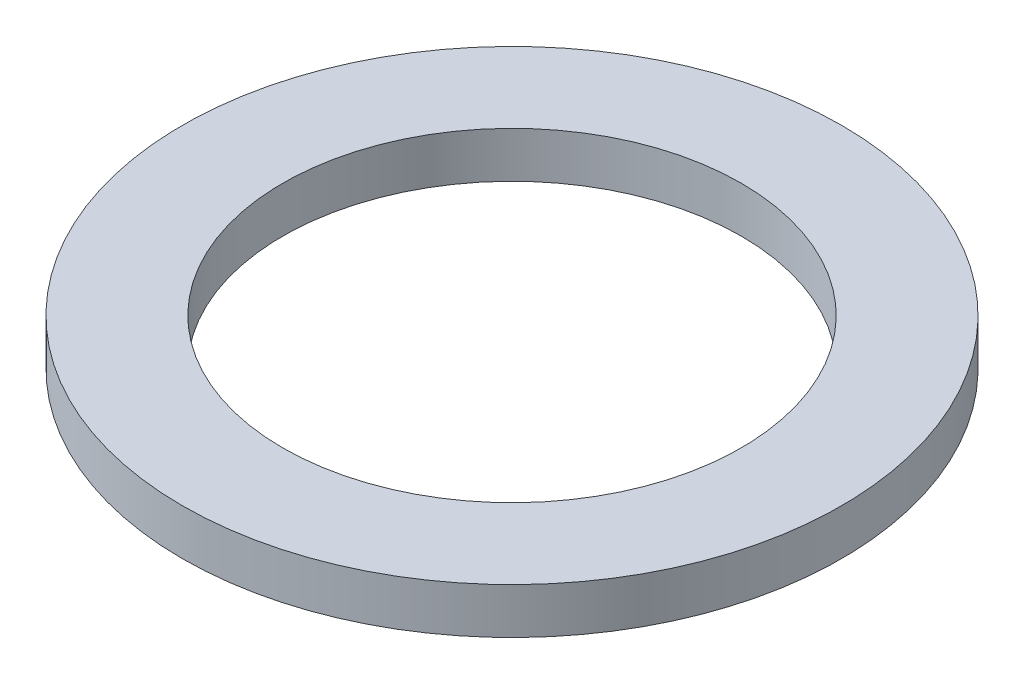
ISO-10303-21;
HEADER;
FILE_DESCRIPTION(('STEP AP214'),'2;1');
FILE_NAME('part.step','',(''),(''),'','','');
FILE_SCHEMA(('AUTOMOTIVE_DESIGN { 1 0 10303 214 1 1 1 1 }'));
ENDSEC;
DATA;
#1=APPLICATION_CONTEXT('core data for automotive mechanical design processes');
#2=APPLICATION_PROTOCOL_DEFINITION('international standard','automotive_design',2000,#1);
#3=PRODUCT_CONTEXT('',#1,'mechanical');
#4=PRODUCT('Part','Part','',(#3));
#5=PRODUCT_RELATED_PRODUCT_CATEGORY('part','',(#4));
#6=PRODUCT_DEFINITION_FORMATION('','',#4);
#7=PRODUCT_DEFINITION_CONTEXT('part definition',#1,'design');
#8=PRODUCT_DEFINITION('design','',#6,#7);
#9=PRODUCT_DEFINITION_SHAPE('','',#8);
#10=(LENGTH_UNIT() NAMED_UNIT(*) SI_UNIT(.MILLI.,.METRE.));
#11=(NAMED_UNIT(*) PLANE_ANGLE_UNIT() SI_UNIT($,.RADIAN.));
#12=(NAMED_UNIT(*) SI_UNIT($,.STERADIAN.) SOLID_ANGLE_UNIT());
#13=UNCERTAINTY_MEASURE_WITH_UNIT(LENGTH_MEASURE(1.E-05),#10,'distance_accuracy_value','');
#14=(GEOMETRIC_REPRESENTATION_CONTEXT(3) GLOBAL_UNCERTAINTY_ASSIGNED_CONTEXT((#13)) GLOBAL_UNIT_ASSIGNED_CONTEXT((#10,
#11,#12)) REPRESENTATION_CONTEXT('',''));
#15=CARTESIAN_POINT('',(0.,0.,0.));
#16=DIRECTION('',(0.,0.,1.));
#17=DIRECTION('',(1.,0.,0.));
#18=AXIS2_PLACEMENT_3D('',#15,#16,#17);
#19=CARTESIAN_POINT('',(0.,8.,0.));
#20=DIRECTION('',(0.,-1.,0.));
#21=DIRECTION('',(0.,0.,-1.));
#22=AXIS2_PLACEMENT_3D('',#19,#20,#21);
#23=CYLINDRICAL_SURFACE('',#22,57.5);
#24=CARTESIAN_POINT('',(0.,8.,0.));
#25=DIRECTION('',(0.,1.,0.));
#26=DIRECTION('',(0.,0.,1.));
#27=AXIS2_PLACEMENT_3D('',#24,#25,#26);
#28=CIRCLE('',#27,57.5);
#29=CARTESIAN_POINT('',(0.,8.,57.5));
#30=VERTEX_POINT('',#29);
#31=EDGE_CURVE('E10',#30,#30,#28,.T.);
#32=ORIENTED_EDGE('',*,*,#31,.F.);
#33=EDGE_LOOP('',(#32));
#34=FACE_BOUND('',#33,.T.);
#35=CARTESIAN_POINT('',(0.,0.,0.));
#36=DIRECTION('',(0.,1.,0.));
#37=DIRECTION('',(0.,0.,1.));
#38=AXIS2_PLACEMENT_3D('',#35,#36,#37);
#39=CIRCLE('',#38,57.5);
#40=CARTESIAN_POINT('',(0.,0.,57.5));
#41=VERTEX_POINT('',#40);
#42=EDGE_CURVE('E37',#41,#41,#39,.T.);
#43=ORIENTED_EDGE('',*,*,#42,.T.);
#44=EDGE_LOOP('',(#43));
#45=FACE_BOUND('',#44,.T.);
#46=ADVANCED_FACE('F40',(#34,#45),#23,.T.);
#47=CARTESIAN_POINT('',(0.,8.,0.));
#48=DIRECTION('',(0.,1.,0.));
#49=DIRECTION('',(0.,0.,1.));
#50=AXIS2_PLACEMENT_3D('',#47,#48,#49);
#51=PLANE('',#50);
#52=CARTESIAN_POINT('',(0.,8.,0.));
#53=DIRECTION('',(0.,1.,0.));
#54=DIRECTION('',(0.,0.,1.));
#55=AXIS2_PLACEMENT_3D('',#52,#53,#54);
#56=CIRCLE('',#55,40.);
#57=CARTESIAN_POINT('',(0.,8.,40.));
#58=VERTEX_POINT('',#57);
#59=EDGE_CURVE('E50',#58,#58,#56,.T.);
#60=ORIENTED_EDGE('',*,*,#59,.F.);
#61=EDGE_LOOP('',(#60));
#62=FACE_BOUND('',#61,.T.);
#63=ORIENTED_EDGE('',*,*,#31,.T.);
#64=EDGE_LOOP('',(#63));
#65=FACE_BOUND('',#64,.T.);
#66=ADVANCED_FACE('F59',(#62,#65),#51,.T.);
#67=CARTESIAN_POINT('',(0.,0.,0.));
#68=DIRECTION('',(0.,1.,0.));
#69=DIRECTION('',(0.,0.,1.));
#70=AXIS2_PLACEMENT_3D('',#67,#68,#69);
#71=PLANE('',#70);
#72=CARTESIAN_POINT('',(0.,0.,0.));
#73=DIRECTION('',(0.,1.,0.));
#74=DIRECTION('',(0.,0.,1.));
#75=AXIS2_PLACEMENT_3D('',#72,#73,#74);
#76=CIRCLE('',#75,40.);
#77=CARTESIAN_POINT('',(0.,0.,40.));
#78=VERTEX_POINT('',#77);
#79=EDGE_CURVE('E47',#78,#78,#76,.T.);
#80=ORIENTED_EDGE('',*,*,#79,.T.);
#81=EDGE_LOOP('',(#80));
#82=FACE_BOUND('',#81,.T.);
#83=ORIENTED_EDGE('',*,*,#42,.F.);
#84=EDGE_LOOP('',(#83));
#85=FACE_BOUND('',#84,.T.);
#86=ADVANCED_FACE('F58',(#82,#85),#71,.F.);
#87=CARTESIAN_POINT('',(0.,8.,0.));
#88=DIRECTION('',(0.,-1.,0.));
#89=DIRECTION('',(0.,0.,-1.));
#90=AXIS2_PLACEMENT_3D('',#87,#88,#89);
#91=CYLINDRICAL_SURFACE('',#90,40.);
#92=ORIENTED_EDGE('',*,*,#59,.T.);
#93=EDGE_LOOP('',(#92));
#94=FACE_BOUND('',#93,.T.);
#95=ORIENTED_EDGE('',*,*,#79,.F.);
#96=EDGE_LOOP('',(#95));
#97=FACE_BOUND('',#96,.T.);
#98=ADVANCED_FACE('F54',(#94,#97),#91,.F.);
#99=CLOSED_SHELL('',(#46,#66,#86,#98));
#100=MANIFOLD_SOLID_BREP('B2',#99);
#101=ADVANCED_BREP_SHAPE_REPRESENTATION('',(#18,#100),#14);
#102=SHAPE_DEFINITION_REPRESENTATION(#9,#101);
ENDSEC;
END-ISO-10303-21;
